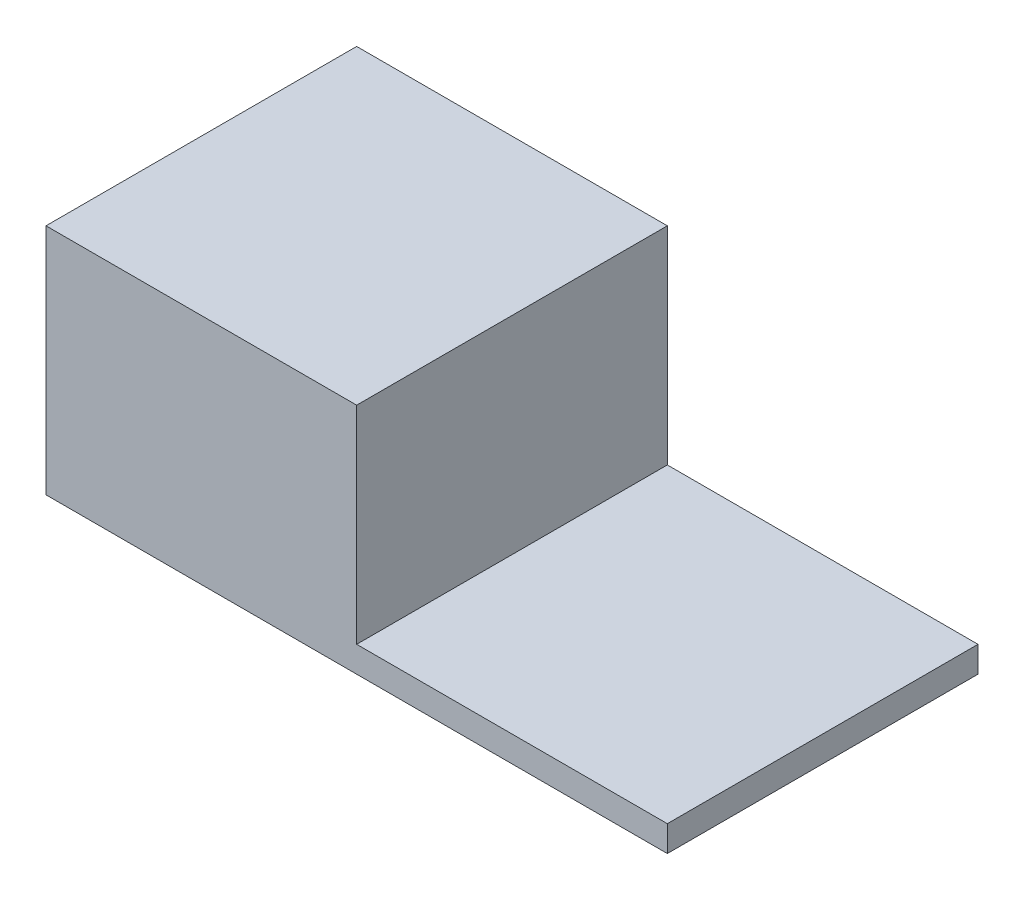
ISO-10303-21;
HEADER;
FILE_DESCRIPTION(('STEP AP214'),'2;1');
FILE_NAME('part.step','',(''),(''),'','','');
FILE_SCHEMA(('AUTOMOTIVE_DESIGN { 1 0 10303 214 1 1 1 1 }'));
ENDSEC;
DATA;
#1=APPLICATION_CONTEXT('core data for automotive mechanical design processes');
#2=APPLICATION_PROTOCOL_DEFINITION('international standard','automotive_design',2000,#1);
#3=PRODUCT_CONTEXT('',#1,'mechanical');
#4=PRODUCT('Part','Part','',(#3));
#5=PRODUCT_RELATED_PRODUCT_CATEGORY('part','',(#4));
#6=PRODUCT_DEFINITION_FORMATION('','',#4);
#7=PRODUCT_DEFINITION_CONTEXT('part definition',#1,'design');
#8=PRODUCT_DEFINITION('design','',#6,#7);
#9=PRODUCT_DEFINITION_SHAPE('','',#8);
#10=(LENGTH_UNIT() NAMED_UNIT(*) SI_UNIT(.MILLI.,.METRE.));
#11=(NAMED_UNIT(*) PLANE_ANGLE_UNIT() SI_UNIT($,.RADIAN.));
#12=(NAMED_UNIT(*) SI_UNIT($,.STERADIAN.) SOLID_ANGLE_UNIT());
#13=UNCERTAINTY_MEASURE_WITH_UNIT(LENGTH_MEASURE(1.E-05),#10,'distance_accuracy_value','');
#14=(GEOMETRIC_REPRESENTATION_CONTEXT(3) GLOBAL_UNCERTAINTY_ASSIGNED_CONTEXT((#13)) GLOBAL_UNIT_ASSIGNED_CONTEXT((#10,
#11,#12)) REPRESENTATION_CONTEXT('',''));
#15=CARTESIAN_POINT('',(0.,0.,0.));
#16=DIRECTION('',(0.,0.,1.));
#17=DIRECTION('',(1.,0.,0.));
#18=AXIS2_PLACEMENT_3D('',#15,#16,#17);
#19=CARTESIAN_POINT('',(0.,0.,600.));
#20=DIRECTION('',(0.,1.,0.));
#21=DIRECTION('',(0.,0.,1.));
#22=AXIS2_PLACEMENT_3D('',#19,#20,#21);
#23=PLANE('',#22);
#24=DIRECTION('',(1.,0.,0.));
#25=VECTOR('',#24,1.);
#26=CARTESIAN_POINT('',(0.,0.,0.));
#27=LINE('',#26,#25);
#28=CARTESIAN_POINT('',(0.,0.,0.));
#29=VERTEX_POINT('',#28);
#30=CARTESIAN_POINT('',(1200.,0.,0.));
#31=VERTEX_POINT('',#30);
#32=EDGE_CURVE('E125',#29,#31,#27,.T.);
#33=ORIENTED_EDGE('',*,*,#32,.T.);
#34=DIRECTION('',(0.,0.,-1.));
#35=VECTOR('',#34,1.);
#36=CARTESIAN_POINT('',(1200.,0.,600.));
#37=LINE('',#36,#35);
#38=CARTESIAN_POINT('',(1200.,0.,600.));
#39=VERTEX_POINT('',#38);
#40=EDGE_CURVE('E11',#39,#31,#37,.T.);
#41=ORIENTED_EDGE('',*,*,#40,.F.);
#42=DIRECTION('',(1.,0.,0.));
#43=VECTOR('',#42,1.);
#44=CARTESIAN_POINT('',(0.,0.,600.));
#45=LINE('',#44,#43);
#46=CARTESIAN_POINT('',(0.,0.,600.));
#47=VERTEX_POINT('',#46);
#48=EDGE_CURVE('E139',#47,#39,#45,.T.);
#49=ORIENTED_EDGE('',*,*,#48,.F.);
#50=DIRECTION('',(0.,0.,-1.));
#51=VECTOR('',#50,1.);
#52=CARTESIAN_POINT('',(0.,0.,600.));
#53=LINE('',#52,#51);
#54=EDGE_CURVE('E57',#47,#29,#53,.T.);
#55=ORIENTED_EDGE('',*,*,#54,.T.);
#56=EDGE_LOOP('',(#33,#41,#49,#55));
#57=FACE_BOUND('',#56,.T.);
#58=ADVANCED_FACE('F41',(#57),#23,.F.);
#59=CARTESIAN_POINT('',(1200.,0.,600.));
#60=DIRECTION('',(-1.,0.,0.));
#61=DIRECTION('',(0.,0.,1.));
#62=AXIS2_PLACEMENT_3D('',#59,#60,#61);
#63=PLANE('',#62);
#64=DIRECTION('',(0.,1.,0.));
#65=VECTOR('',#64,1.);
#66=CARTESIAN_POINT('',(1200.,0.,0.));
#67=LINE('',#66,#65);
#68=CARTESIAN_POINT('',(1200.,50.,0.));
#69=VERTEX_POINT('',#68);
#70=EDGE_CURVE('E127',#31,#69,#67,.T.);
#71=ORIENTED_EDGE('',*,*,#70,.T.);
#72=DIRECTION('',(0.,0.,-1.));
#73=VECTOR('',#72,1.);
#74=CARTESIAN_POINT('',(1200.,50.,600.));
#75=LINE('',#74,#73);
#76=CARTESIAN_POINT('',(1200.,50.,600.));
#77=VERTEX_POINT('',#76);
#78=EDGE_CURVE('E49',#77,#69,#75,.T.);
#79=ORIENTED_EDGE('',*,*,#78,.F.);
#80=DIRECTION('',(0.,1.,0.));
#81=VECTOR('',#80,1.);
#82=CARTESIAN_POINT('',(1200.,0.,600.));
#83=LINE('',#82,#81);
#84=EDGE_CURVE('E89',#39,#77,#83,.T.);
#85=ORIENTED_EDGE('',*,*,#84,.F.);
#86=ORIENTED_EDGE('',*,*,#40,.T.);
#87=EDGE_LOOP('',(#71,#79,#85,#86));
#88=FACE_BOUND('',#87,.T.);
#89=ADVANCED_FACE('F145',(#88),#63,.F.);
#90=CARTESIAN_POINT('',(0.,50.,600.));
#91=DIRECTION('',(0.,1.,0.));
#92=DIRECTION('',(0.,0.,1.));
#93=AXIS2_PLACEMENT_3D('',#90,#91,#92);
#94=PLANE('',#93);
#95=DIRECTION('',(1.,0.,0.));
#96=VECTOR('',#95,1.);
#97=CARTESIAN_POINT('',(0.,50.,0.));
#98=LINE('',#97,#96);
#99=CARTESIAN_POINT('',(600.,50.,0.));
#100=VERTEX_POINT('',#99);
#101=EDGE_CURVE('E130',#100,#69,#98,.T.);
#102=ORIENTED_EDGE('',*,*,#101,.F.);
#103=DIRECTION('',(0.,0.,-1.));
#104=VECTOR('',#103,1.);
#105=CARTESIAN_POINT('',(600.,50.,600.));
#106=LINE('',#105,#104);
#107=CARTESIAN_POINT('',(600.,50.,600.));
#108=VERTEX_POINT('',#107);
#109=EDGE_CURVE('E117',#108,#100,#106,.T.);
#110=ORIENTED_EDGE('',*,*,#109,.F.);
#111=DIRECTION('',(1.,0.,0.));
#112=VECTOR('',#111,1.);
#113=CARTESIAN_POINT('',(0.,50.,600.));
#114=LINE('',#113,#112);
#115=EDGE_CURVE('E107',#108,#77,#114,.T.);
#116=ORIENTED_EDGE('',*,*,#115,.T.);
#117=ORIENTED_EDGE('',*,*,#78,.T.);
#118=EDGE_LOOP('',(#102,#110,#116,#117));
#119=FACE_BOUND('',#118,.T.);
#120=ADVANCED_FACE('F144',(#119),#94,.T.);
#121=CARTESIAN_POINT('',(600.,1.66533453693773E-13,600.));
#122=DIRECTION('',(-1.,0.,0.));
#123=DIRECTION('',(0.,-1.,0.));
#124=AXIS2_PLACEMENT_3D('',#121,#122,#123);
#125=PLANE('',#124);
#126=DIRECTION('',(0.,1.,0.));
#127=VECTOR('',#126,1.);
#128=CARTESIAN_POINT('',(600.,1.66533453693773E-13,0.));
#129=LINE('',#128,#127);
#130=CARTESIAN_POINT('',(600.,450.,0.));
#131=VERTEX_POINT('',#130);
#132=EDGE_CURVE('E114',#100,#131,#129,.T.);
#133=ORIENTED_EDGE('',*,*,#132,.T.);
#134=DIRECTION('',(0.,0.,-1.));
#135=VECTOR('',#134,1.);
#136=CARTESIAN_POINT('',(600.,450.,600.));
#137=LINE('',#136,#135);
#138=CARTESIAN_POINT('',(600.,450.,600.));
#139=VERTEX_POINT('',#138);
#140=EDGE_CURVE('E111',#139,#131,#137,.T.);
#141=ORIENTED_EDGE('',*,*,#140,.F.);
#142=DIRECTION('',(0.,1.,0.));
#143=VECTOR('',#142,1.);
#144=CARTESIAN_POINT('',(600.,1.66533453693773E-13,600.));
#145=LINE('',#144,#143);
#146=EDGE_CURVE('E100',#108,#139,#145,.T.);
#147=ORIENTED_EDGE('',*,*,#146,.F.);
#148=ORIENTED_EDGE('',*,*,#109,.T.);
#149=EDGE_LOOP('',(#133,#141,#147,#148));
#150=FACE_BOUND('',#149,.T.);
#151=ADVANCED_FACE('F112',(#150),#125,.F.);
#152=CARTESIAN_POINT('',(0.,450.,600.));
#153=DIRECTION('',(0.,1.,0.));
#154=DIRECTION('',(0.,0.,1.));
#155=AXIS2_PLACEMENT_3D('',#152,#153,#154);
#156=PLANE('',#155);
#157=DIRECTION('',(1.,0.,0.));
#158=VECTOR('',#157,1.);
#159=CARTESIAN_POINT('',(0.,450.,0.));
#160=LINE('',#159,#158);
#161=CARTESIAN_POINT('',(0.,450.,0.));
#162=VERTEX_POINT('',#161);
#163=EDGE_CURVE('E134',#162,#131,#160,.T.);
#164=ORIENTED_EDGE('',*,*,#163,.F.);
#165=DIRECTION('',(0.,0.,-1.));
#166=VECTOR('',#165,1.);
#167=CARTESIAN_POINT('',(0.,450.,600.));
#168=LINE('',#167,#166);
#169=CARTESIAN_POINT('',(0.,450.,600.));
#170=VERTEX_POINT('',#169);
#171=EDGE_CURVE('E77',#170,#162,#168,.T.);
#172=ORIENTED_EDGE('',*,*,#171,.F.);
#173=DIRECTION('',(1.,0.,0.));
#174=VECTOR('',#173,1.);
#175=CARTESIAN_POINT('',(0.,450.,600.));
#176=LINE('',#175,#174);
#177=EDGE_CURVE('E105',#170,#139,#176,.T.);
#178=ORIENTED_EDGE('',*,*,#177,.T.);
#179=ORIENTED_EDGE('',*,*,#140,.T.);
#180=EDGE_LOOP('',(#164,#172,#178,#179));
#181=FACE_BOUND('',#180,.T.);
#182=ADVANCED_FACE('F119',(#181),#156,.T.);
#183=CARTESIAN_POINT('',(0.,0.,600.));
#184=DIRECTION('',(-1.,0.,0.));
#185=DIRECTION('',(0.,0.,1.));
#186=AXIS2_PLACEMENT_3D('',#183,#184,#185);
#187=PLANE('',#186);
#188=DIRECTION('',(0.,1.,0.));
#189=VECTOR('',#188,1.);
#190=CARTESIAN_POINT('',(0.,0.,0.));
#191=LINE('',#190,#189);
#192=EDGE_CURVE('E136',#29,#162,#191,.T.);
#193=ORIENTED_EDGE('',*,*,#192,.F.);
#194=ORIENTED_EDGE('',*,*,#54,.F.);
#195=DIRECTION('',(0.,1.,0.));
#196=VECTOR('',#195,1.);
#197=CARTESIAN_POINT('',(0.,0.,600.));
#198=LINE('',#197,#196);
#199=EDGE_CURVE('E120',#47,#170,#198,.T.);
#200=ORIENTED_EDGE('',*,*,#199,.T.);
#201=ORIENTED_EDGE('',*,*,#171,.T.);
#202=EDGE_LOOP('',(#193,#194,#200,#201));
#203=FACE_BOUND('',#202,.T.);
#204=ADVANCED_FACE('F149',(#203),#187,.T.);
#205=CARTESIAN_POINT('',(0.,0.,600.));
#206=DIRECTION('',(0.,0.,1.));
#207=DIRECTION('',(1.,0.,0.));
#208=AXIS2_PLACEMENT_3D('',#205,#206,#207);
#209=PLANE('',#208);
#210=ORIENTED_EDGE('',*,*,#48,.T.);
#211=ORIENTED_EDGE('',*,*,#84,.T.);
#212=ORIENTED_EDGE('',*,*,#115,.F.);
#213=ORIENTED_EDGE('',*,*,#146,.T.);
#214=ORIENTED_EDGE('',*,*,#177,.F.);
#215=ORIENTED_EDGE('',*,*,#199,.F.);
#216=EDGE_LOOP('',(#210,#211,#212,#213,#214,#215));
#217=FACE_BOUND('',#216,.T.);
#218=ADVANCED_FACE('F102',(#217),#209,.T.);
#219=CARTESIAN_POINT('',(0.,0.,0.));
#220=DIRECTION('',(0.,0.,1.));
#221=DIRECTION('',(1.,0.,0.));
#222=AXIS2_PLACEMENT_3D('',#219,#220,#221);
#223=PLANE('',#222);
#224=ORIENTED_EDGE('',*,*,#32,.F.);
#225=ORIENTED_EDGE('',*,*,#192,.T.);
#226=ORIENTED_EDGE('',*,*,#163,.T.);
#227=ORIENTED_EDGE('',*,*,#132,.F.);
#228=ORIENTED_EDGE('',*,*,#101,.T.);
#229=ORIENTED_EDGE('',*,*,#70,.F.);
#230=EDGE_LOOP('',(#224,#225,#226,#227,#228,#229));
#231=FACE_BOUND('',#230,.T.);
#232=ADVANCED_FACE('F148',(#231),#223,.F.);
#233=CLOSED_SHELL('',(#58,#89,#120,#151,#182,#204,#218,#232));
#234=MANIFOLD_SOLID_BREP('B2',#233);
#235=ADVANCED_BREP_SHAPE_REPRESENTATION('',(#18,#234),#14);
#236=SHAPE_DEFINITION_REPRESENTATION(#9,#235);
ENDSEC;
END-ISO-10303-21;
